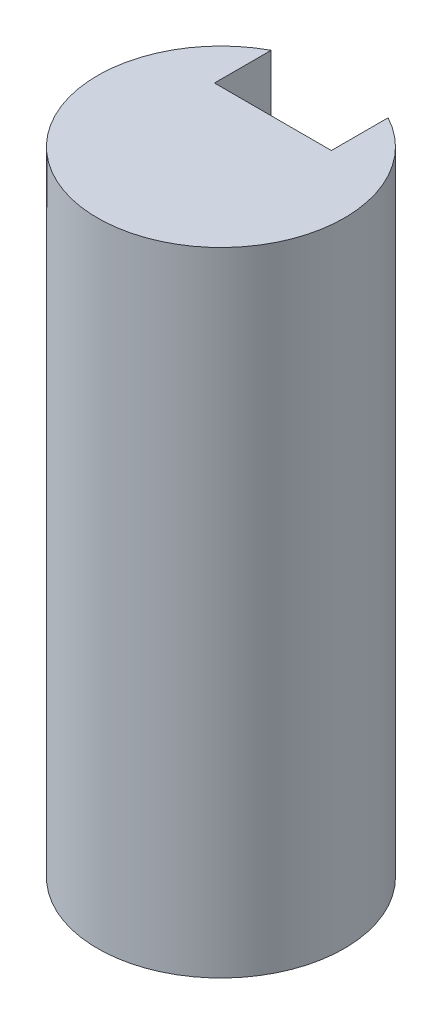
ISO-10303-21;
HEADER;
FILE_DESCRIPTION(('STEP AP214'),'2;1');
FILE_NAME('part.step','',(''),(''),'','','');
FILE_SCHEMA(('AUTOMOTIVE_DESIGN { 1 0 10303 214 1 1 1 1 }'));
ENDSEC;
DATA;
#1=APPLICATION_CONTEXT('core data for automotive mechanical design processes');
#2=APPLICATION_PROTOCOL_DEFINITION('international standard','automotive_design',2000,#1);
#3=PRODUCT_CONTEXT('',#1,'mechanical');
#4=PRODUCT('Part','Part','',(#3));
#5=PRODUCT_RELATED_PRODUCT_CATEGORY('part','',(#4));
#6=PRODUCT_DEFINITION_FORMATION('','',#4);
#7=PRODUCT_DEFINITION_CONTEXT('part definition',#1,'design');
#8=PRODUCT_DEFINITION('design','',#6,#7);
#9=PRODUCT_DEFINITION_SHAPE('','',#8);
#10=(LENGTH_UNIT() NAMED_UNIT(*) SI_UNIT(.MILLI.,.METRE.));
#11=(NAMED_UNIT(*) PLANE_ANGLE_UNIT() SI_UNIT($,.RADIAN.));
#12=(NAMED_UNIT(*) SI_UNIT($,.STERADIAN.) SOLID_ANGLE_UNIT());
#13=UNCERTAINTY_MEASURE_WITH_UNIT(LENGTH_MEASURE(1.E-05),#10,'distance_accuracy_value','');
#14=(GEOMETRIC_REPRESENTATION_CONTEXT(3) GLOBAL_UNCERTAINTY_ASSIGNED_CONTEXT((#13)) GLOBAL_UNIT_ASSIGNED_CONTEXT((#10,
#11,#12)) REPRESENTATION_CONTEXT('',''));
#15=CARTESIAN_POINT('',(0.,0.,0.));
#16=DIRECTION('',(0.,0.,1.));
#17=DIRECTION('',(1.,0.,0.));
#18=AXIS2_PLACEMENT_3D('',#15,#16,#17);
#19=CARTESIAN_POINT('',(0.,-30.,0.));
#20=DIRECTION('',(0.,1.,0.));
#21=DIRECTION('',(0.,0.,1.));
#22=AXIS2_PLACEMENT_3D('',#19,#20,#21);
#23=PLANE('',#22);
#24=DIRECTION('',(0.,0.,-1.));
#25=VECTOR('',#24,1.);
#26=CARTESIAN_POINT('',(4.5,-30.,-4.));
#27=LINE('',#26,#25);
#28=CARTESIAN_POINT('',(4.5,-30.,-4.));
#29=VERTEX_POINT('',#28);
#30=CARTESIAN_POINT('',(4.5,-30.,-8.36660026534075));
#31=VERTEX_POINT('',#30);
#32=EDGE_CURVE('E171',#29,#31,#27,.T.);
#33=ORIENTED_EDGE('',*,*,#32,.F.);
#34=DIRECTION('',(-1.,0.,0.));
#35=VECTOR('',#34,1.);
#36=CARTESIAN_POINT('',(4.5,-30.,-4.));
#37=LINE('',#36,#35);
#38=CARTESIAN_POINT('',(-4.5,-30.,-4.));
#39=VERTEX_POINT('',#38);
#40=EDGE_CURVE('E168',#29,#39,#37,.T.);
#41=ORIENTED_EDGE('',*,*,#40,.T.);
#42=DIRECTION('',(0.,0.,-1.));
#43=VECTOR('',#42,1.);
#44=CARTESIAN_POINT('',(-4.5,-30.,-4.));
#45=LINE('',#44,#43);
#46=CARTESIAN_POINT('',(-4.5,-30.,-8.36660026534076));
#47=VERTEX_POINT('',#46);
#48=EDGE_CURVE('E160',#39,#47,#45,.T.);
#49=ORIENTED_EDGE('',*,*,#48,.T.);
#50=CARTESIAN_POINT('',(0.,-30.,0.));
#51=DIRECTION('',(0.,1.,0.));
#52=DIRECTION('',(0.,0.,1.));
#53=AXIS2_PLACEMENT_3D('',#50,#51,#52);
#54=CIRCLE('',#53,9.5);
#55=EDGE_CURVE('E182',#31,#47,#54,.T.);
#56=ORIENTED_EDGE('',*,*,#55,.F.);
#57=EDGE_LOOP('',(#33,#41,#49,#56));
#58=FACE_BOUND('',#57,.T.);
#59=ADVANCED_FACE('F82',(#58),#23,.F.);
#60=CARTESIAN_POINT('',(0.,12.7,0.));
#61=DIRECTION('',(0.,-1.,0.));
#62=DIRECTION('',(0.,0.,-1.));
#63=AXIS2_PLACEMENT_3D('',#60,#61,#62);
#64=CYLINDRICAL_SURFACE('',#63,9.5);
#65=DIRECTION('',(0.,-1.,0.));
#66=VECTOR('',#65,1.);
#67=CARTESIAN_POINT('',(-4.5,12.7,-8.36660026534076));
#68=LINE('',#67,#66);
#69=CARTESIAN_POINT('',(-4.5,12.7,-8.36660026534076));
#70=VERTEX_POINT('',#69);
#71=CARTESIAN_POINT('',(-4.5,0.,-8.36660026534076));
#72=VERTEX_POINT('',#71);
#73=EDGE_CURVE('E90',#70,#72,#68,.T.);
#74=ORIENTED_EDGE('',*,*,#73,.T.);
#75=CARTESIAN_POINT('',(0.,0.,0.));
#76=DIRECTION('',(0.,1.,0.));
#77=DIRECTION('',(0.,0.,1.));
#78=AXIS2_PLACEMENT_3D('',#75,#76,#77);
#79=CIRCLE('',#78,9.5);
#80=CARTESIAN_POINT('',(4.5,0.,-8.36660026534075));
#81=VERTEX_POINT('',#80);
#82=EDGE_CURVE('E181',#81,#72,#79,.T.);
#83=ORIENTED_EDGE('',*,*,#82,.F.);
#84=DIRECTION('',(0.,-1.,0.));
#85=VECTOR('',#84,1.);
#86=CARTESIAN_POINT('',(4.5,12.7,-8.36660026534075));
#87=LINE('',#86,#85);
#88=CARTESIAN_POINT('',(4.5,12.7,-8.36660026534075));
#89=VERTEX_POINT('',#88);
#90=EDGE_CURVE('E12',#89,#81,#87,.T.);
#91=ORIENTED_EDGE('',*,*,#90,.F.);
#92=CARTESIAN_POINT('',(0.,12.7,0.));
#93=DIRECTION('',(0.,1.,0.));
#94=DIRECTION('',(0.,0.,1.));
#95=AXIS2_PLACEMENT_3D('',#92,#93,#94);
#96=CIRCLE('',#95,9.5);
#97=EDGE_CURVE('E206',#70,#89,#96,.T.);
#98=ORIENTED_EDGE('',*,*,#97,.F.);
#99=EDGE_LOOP('',(#74,#83,#91,#98));
#100=FACE_BOUND('',#99,.T.);
#101=ORIENTED_EDGE('',*,*,#55,.T.);
#102=DIRECTION('',(0.,1.,0.));
#103=VECTOR('',#102,1.);
#104=CARTESIAN_POINT('',(-4.5,-36.,-8.36660026534076));
#105=LINE('',#104,#103);
#106=CARTESIAN_POINT('',(-4.5,-36.,-8.36660026534076));
#107=VERTEX_POINT('',#106);
#108=EDGE_CURVE('E97',#107,#47,#105,.T.);
#109=ORIENTED_EDGE('',*,*,#108,.F.);
#110=CARTESIAN_POINT('',(0.,-36.,0.));
#111=DIRECTION('',(0.,-1.,0.));
#112=DIRECTION('',(0.,0.,-1.));
#113=AXIS2_PLACEMENT_3D('',#110,#111,#112);
#114=CIRCLE('',#113,9.5);
#115=CARTESIAN_POINT('',(4.5,-36.,-8.36660026534075));
#116=VERTEX_POINT('',#115);
#117=EDGE_CURVE('E165',#116,#107,#114,.T.);
#118=ORIENTED_EDGE('',*,*,#117,.F.);
#119=DIRECTION('',(0.,1.,0.));
#120=VECTOR('',#119,1.);
#121=CARTESIAN_POINT('',(4.5,-36.,-8.36660026534075));
#122=LINE('',#121,#120);
#123=EDGE_CURVE('E178',#116,#31,#122,.T.);
#124=ORIENTED_EDGE('',*,*,#123,.T.);
#125=EDGE_LOOP('',(#101,#109,#118,#124));
#126=FACE_BOUND('',#125,.T.);
#127=ADVANCED_FACE('F84',(#100,#126),#64,.T.);
#128=CARTESIAN_POINT('',(0.,12.7,0.));
#129=DIRECTION('',(0.,1.,0.));
#130=DIRECTION('',(0.,0.,1.));
#131=AXIS2_PLACEMENT_3D('',#128,#129,#130);
#132=PLANE('',#131);
#133=DIRECTION('',(0.,0.,-1.));
#134=VECTOR('',#133,1.);
#135=CARTESIAN_POINT('',(-4.5,12.7,-4.));
#136=LINE('',#135,#134);
#137=CARTESIAN_POINT('',(-4.5,12.7,-4.));
#138=VERTEX_POINT('',#137);
#139=EDGE_CURVE('E188',#138,#70,#136,.T.);
#140=ORIENTED_EDGE('',*,*,#139,.T.);
#141=ORIENTED_EDGE('',*,*,#97,.T.);
#142=DIRECTION('',(0.,0.,-1.));
#143=VECTOR('',#142,1.);
#144=CARTESIAN_POINT('',(4.5,12.7,-4.));
#145=LINE('',#144,#143);
#146=CARTESIAN_POINT('',(4.5,12.7,-4.));
#147=VERTEX_POINT('',#146);
#148=EDGE_CURVE('E194',#147,#89,#145,.T.);
#149=ORIENTED_EDGE('',*,*,#148,.F.);
#150=DIRECTION('',(-1.,0.,0.));
#151=VECTOR('',#150,1.);
#152=CARTESIAN_POINT('',(4.5,12.7,-4.));
#153=LINE('',#152,#151);
#154=EDGE_CURVE('E190',#147,#138,#153,.T.);
#155=ORIENTED_EDGE('',*,*,#154,.T.);
#156=EDGE_LOOP('',(#140,#141,#149,#155));
#157=FACE_BOUND('',#156,.T.);
#158=ADVANCED_FACE('F223',(#157),#132,.T.);
#159=CARTESIAN_POINT('',(-4.5,12.7,-4.));
#160=DIRECTION('',(-1.,0.,0.));
#161=DIRECTION('',(0.,0.,1.));
#162=AXIS2_PLACEMENT_3D('',#159,#160,#161);
#163=PLANE('',#162);
#164=ORIENTED_EDGE('',*,*,#139,.F.);
#165=DIRECTION('',(0.,-1.,0.));
#166=VECTOR('',#165,1.);
#167=CARTESIAN_POINT('',(-4.5,12.7,-4.));
#168=LINE('',#167,#166);
#169=CARTESIAN_POINT('',(-4.5,0.,-4.));
#170=VERTEX_POINT('',#169);
#171=EDGE_CURVE('E204',#138,#170,#168,.T.);
#172=ORIENTED_EDGE('',*,*,#171,.T.);
#173=DIRECTION('',(0.,0.,-1.));
#174=VECTOR('',#173,1.);
#175=CARTESIAN_POINT('',(-4.5,0.,-4.));
#176=LINE('',#175,#174);
#177=EDGE_CURVE('E185',#170,#72,#176,.T.);
#178=ORIENTED_EDGE('',*,*,#177,.T.);
#179=ORIENTED_EDGE('',*,*,#73,.F.);
#180=EDGE_LOOP('',(#164,#172,#178,#179));
#181=FACE_BOUND('',#180,.T.);
#182=ADVANCED_FACE('F224',(#181),#163,.F.);
#183=CARTESIAN_POINT('',(4.5,12.7,-4.));
#184=DIRECTION('',(-1.,0.,0.));
#185=DIRECTION('',(0.,0.,1.));
#186=AXIS2_PLACEMENT_3D('',#183,#184,#185);
#187=PLANE('',#186);
#188=ORIENTED_EDGE('',*,*,#90,.T.);
#189=DIRECTION('',(0.,0.,-1.));
#190=VECTOR('',#189,1.);
#191=CARTESIAN_POINT('',(4.5,0.,-4.));
#192=LINE('',#191,#190);
#193=CARTESIAN_POINT('',(4.5,0.,-4.));
#194=VERTEX_POINT('',#193);
#195=EDGE_CURVE('E191',#194,#81,#192,.T.);
#196=ORIENTED_EDGE('',*,*,#195,.F.);
#197=DIRECTION('',(0.,-1.,0.));
#198=VECTOR('',#197,1.);
#199=CARTESIAN_POINT('',(4.5,12.7,-4.));
#200=LINE('',#199,#198);
#201=EDGE_CURVE('E196',#147,#194,#200,.T.);
#202=ORIENTED_EDGE('',*,*,#201,.F.);
#203=ORIENTED_EDGE('',*,*,#148,.T.);
#204=EDGE_LOOP('',(#188,#196,#202,#203));
#205=FACE_BOUND('',#204,.T.);
#206=ADVANCED_FACE('F219',(#205),#187,.T.);
#207=CARTESIAN_POINT('',(4.5,12.7,-4.));
#208=DIRECTION('',(0.,0.,1.));
#209=DIRECTION('',(1.,0.,0.));
#210=AXIS2_PLACEMENT_3D('',#207,#208,#209);
#211=PLANE('',#210);
#212=DIRECTION('',(-1.,0.,0.));
#213=VECTOR('',#212,1.);
#214=CARTESIAN_POINT('',(4.5,0.,-4.));
#215=LINE('',#214,#213);
#216=EDGE_CURVE('E198',#194,#170,#215,.T.);
#217=ORIENTED_EDGE('',*,*,#216,.T.);
#218=ORIENTED_EDGE('',*,*,#171,.F.);
#219=ORIENTED_EDGE('',*,*,#154,.F.);
#220=ORIENTED_EDGE('',*,*,#201,.T.);
#221=EDGE_LOOP('',(#217,#218,#219,#220));
#222=FACE_BOUND('',#221,.T.);
#223=ADVANCED_FACE('F226',(#222),#211,.F.);
#224=CARTESIAN_POINT('',(0.,0.,0.));
#225=DIRECTION('',(0.,1.,0.));
#226=DIRECTION('',(0.,0.,1.));
#227=AXIS2_PLACEMENT_3D('',#224,#225,#226);
#228=PLANE('',#227);
#229=ORIENTED_EDGE('',*,*,#177,.F.);
#230=ORIENTED_EDGE('',*,*,#216,.F.);
#231=ORIENTED_EDGE('',*,*,#195,.T.);
#232=ORIENTED_EDGE('',*,*,#82,.T.);
#233=EDGE_LOOP('',(#229,#230,#231,#232));
#234=FACE_BOUND('',#233,.T.);
#235=ADVANCED_FACE('F215',(#234),#228,.T.);
#236=CARTESIAN_POINT('',(0.,-36.,0.));
#237=DIRECTION('',(0.,-1.,0.));
#238=DIRECTION('',(0.,0.,-1.));
#239=AXIS2_PLACEMENT_3D('',#236,#237,#238);
#240=PLANE('',#239);
#241=DIRECTION('',(0.,0.,-1.));
#242=VECTOR('',#241,1.);
#243=CARTESIAN_POINT('',(4.5,-36.,-4.));
#244=LINE('',#243,#242);
#245=CARTESIAN_POINT('',(4.5,-36.,-4.));
#246=VERTEX_POINT('',#245);
#247=EDGE_CURVE('E166',#246,#116,#244,.T.);
#248=ORIENTED_EDGE('',*,*,#247,.T.);
#249=ORIENTED_EDGE('',*,*,#117,.T.);
#250=DIRECTION('',(0.,0.,-1.));
#251=VECTOR('',#250,1.);
#252=CARTESIAN_POINT('',(-4.5,-36.,-4.));
#253=LINE('',#252,#251);
#254=CARTESIAN_POINT('',(-4.5,-36.,-4.));
#255=VERTEX_POINT('',#254);
#256=EDGE_CURVE('E156',#255,#107,#253,.T.);
#257=ORIENTED_EDGE('',*,*,#256,.F.);
#258=DIRECTION('',(-1.,0.,0.));
#259=VECTOR('',#258,1.);
#260=CARTESIAN_POINT('',(4.5,-36.,-4.));
#261=LINE('',#260,#259);
#262=EDGE_CURVE('E146',#246,#255,#261,.T.);
#263=ORIENTED_EDGE('',*,*,#262,.F.);
#264=EDGE_LOOP('',(#248,#249,#257,#263));
#265=FACE_BOUND('',#264,.T.);
#266=ADVANCED_FACE('F163',(#265),#240,.T.);
#267=CARTESIAN_POINT('',(4.5,-36.,-4.));
#268=DIRECTION('',(1.,0.,0.));
#269=DIRECTION('',(0.,0.,-1.));
#270=AXIS2_PLACEMENT_3D('',#267,#268,#269);
#271=PLANE('',#270);
#272=ORIENTED_EDGE('',*,*,#247,.F.);
#273=DIRECTION('',(0.,1.,0.));
#274=VECTOR('',#273,1.);
#275=CARTESIAN_POINT('',(4.5,-36.,-4.));
#276=LINE('',#275,#274);
#277=EDGE_CURVE('E151',#246,#29,#276,.T.);
#278=ORIENTED_EDGE('',*,*,#277,.T.);
#279=ORIENTED_EDGE('',*,*,#32,.T.);
#280=ORIENTED_EDGE('',*,*,#123,.F.);
#281=EDGE_LOOP('',(#272,#278,#279,#280));
#282=FACE_BOUND('',#281,.T.);
#283=ADVANCED_FACE('F246',(#282),#271,.F.);
#284=CARTESIAN_POINT('',(-4.5,-36.,-4.));
#285=DIRECTION('',(1.,0.,0.));
#286=DIRECTION('',(0.,0.,-1.));
#287=AXIS2_PLACEMENT_3D('',#284,#285,#286);
#288=PLANE('',#287);
#289=ORIENTED_EDGE('',*,*,#108,.T.);
#290=ORIENTED_EDGE('',*,*,#48,.F.);
#291=DIRECTION('',(0.,1.,0.));
#292=VECTOR('',#291,1.);
#293=CARTESIAN_POINT('',(-4.5,-36.,-4.));
#294=LINE('',#293,#292);
#295=EDGE_CURVE('E150',#255,#39,#294,.T.);
#296=ORIENTED_EDGE('',*,*,#295,.F.);
#297=ORIENTED_EDGE('',*,*,#256,.T.);
#298=EDGE_LOOP('',(#289,#290,#296,#297));
#299=FACE_BOUND('',#298,.T.);
#300=ADVANCED_FACE('F158',(#299),#288,.T.);
#301=CARTESIAN_POINT('',(4.5,-36.,-4.));
#302=DIRECTION('',(0.,0.,-1.));
#303=DIRECTION('',(-1.,0.,0.));
#304=AXIS2_PLACEMENT_3D('',#301,#302,#303);
#305=PLANE('',#304);
#306=ORIENTED_EDGE('',*,*,#40,.F.);
#307=ORIENTED_EDGE('',*,*,#277,.F.);
#308=ORIENTED_EDGE('',*,*,#262,.T.);
#309=ORIENTED_EDGE('',*,*,#295,.T.);
#310=EDGE_LOOP('',(#306,#307,#308,#309));
#311=FACE_BOUND('',#310,.T.);
#312=ADVANCED_FACE('F149',(#311),#305,.T.);
#313=CLOSED_SHELL('',(#59,#127,#158,#182,#206,#223,#235,#266,#283,#300,#312));
#314=MANIFOLD_SOLID_BREP('B2',#313);
#315=ADVANCED_BREP_SHAPE_REPRESENTATION('',(#18,#314),#14);
#316=SHAPE_DEFINITION_REPRESENTATION(#9,#315);
ENDSEC;
END-ISO-10303-21;
